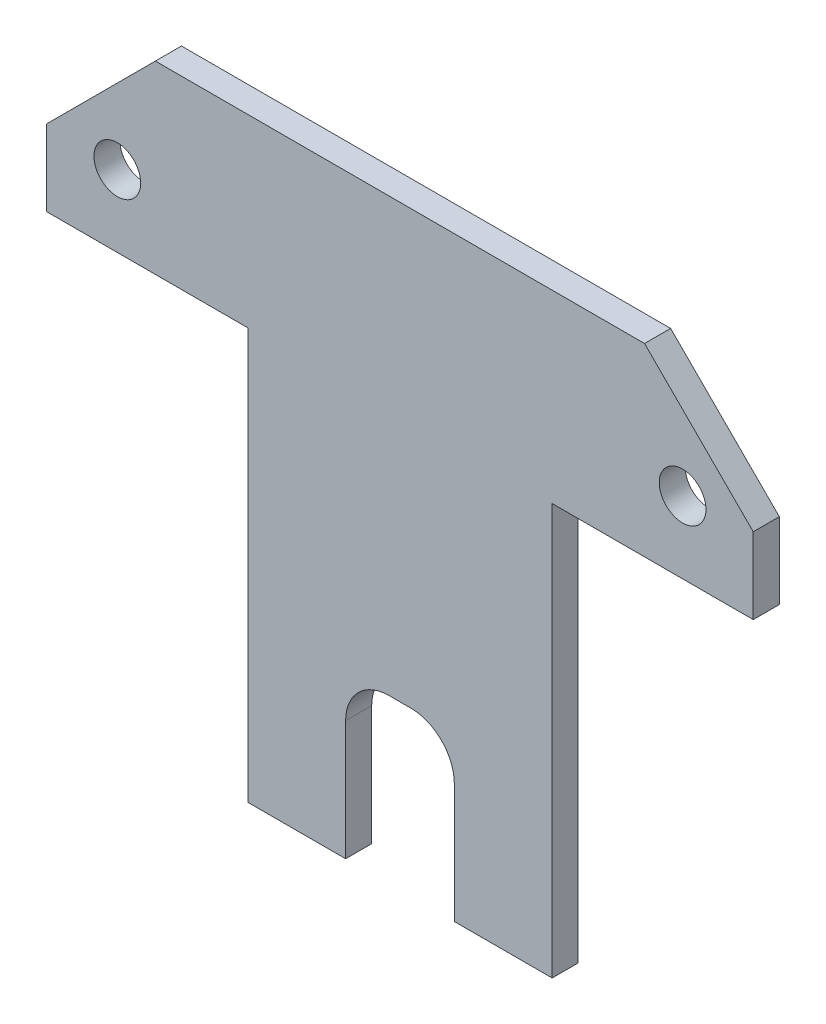
ISO-10303-21;
HEADER;
FILE_DESCRIPTION(('STEP AP214'),'2;1');
FILE_NAME('part.step','',(''),(''),'','','');
FILE_SCHEMA(('AUTOMOTIVE_DESIGN { 1 0 10303 214 1 1 1 1 }'));
ENDSEC;
DATA;
#1=APPLICATION_CONTEXT('core data for automotive mechanical design processes');
#2=APPLICATION_PROTOCOL_DEFINITION('international standard','automotive_design',2000,#1);
#3=PRODUCT_CONTEXT('',#1,'mechanical');
#4=PRODUCT('Part','Part','',(#3));
#5=PRODUCT_RELATED_PRODUCT_CATEGORY('part','',(#4));
#6=PRODUCT_DEFINITION_FORMATION('','',#4);
#7=PRODUCT_DEFINITION_CONTEXT('part definition',#1,'design');
#8=PRODUCT_DEFINITION('design','',#6,#7);
#9=PRODUCT_DEFINITION_SHAPE('','',#8);
#10=(LENGTH_UNIT() NAMED_UNIT(*) SI_UNIT(.MILLI.,.METRE.));
#11=(NAMED_UNIT(*) PLANE_ANGLE_UNIT() SI_UNIT($,.RADIAN.));
#12=(NAMED_UNIT(*) SI_UNIT($,.STERADIAN.) SOLID_ANGLE_UNIT());
#13=UNCERTAINTY_MEASURE_WITH_UNIT(LENGTH_MEASURE(1.E-05),#10,'distance_accuracy_value','');
#14=(GEOMETRIC_REPRESENTATION_CONTEXT(3) GLOBAL_UNCERTAINTY_ASSIGNED_CONTEXT((#13)) GLOBAL_UNIT_ASSIGNED_CONTEXT((#10,
#11,#12)) REPRESENTATION_CONTEXT('',''));
#15=CARTESIAN_POINT('',(0.,0.,0.));
#16=DIRECTION('',(0.,0.,1.));
#17=DIRECTION('',(1.,0.,0.));
#18=AXIS2_PLACEMENT_3D('',#15,#16,#17);
#19=CARTESIAN_POINT('',(15.3944155171797,-21.7253473807906,2.4));
#20=DIRECTION('',(0.,1.,0.));
#21=DIRECTION('',(0.,0.,1.));
#22=AXIS2_PLACEMENT_3D('',#19,#20,#21);
#23=PLANE('',#22);
#24=DIRECTION('',(1.,0.,0.));
#25=VECTOR('',#24,1.);
#26=CARTESIAN_POINT('',(15.3944155171797,-21.7253473807906,0.));
#27=LINE('',#26,#25);
#28=CARTESIAN_POINT('',(-12.6055844828203,-21.7253473807906,0.));
#29=VERTEX_POINT('',#28);
#30=CARTESIAN_POINT('',(-3.60558448282027,-21.7253473807906,0.));
#31=VERTEX_POINT('',#30);
#32=EDGE_CURVE('E161',#29,#31,#27,.T.);
#33=ORIENTED_EDGE('',*,*,#32,.T.);
#34=DIRECTION('',(0.,0.,1.));
#35=VECTOR('',#34,1.);
#36=CARTESIAN_POINT('',(-3.60558448282027,-21.7253473807906,2.4));
#37=LINE('',#36,#35);
#38=CARTESIAN_POINT('',(-3.60558448282027,-21.7253473807906,2.4));
#39=VERTEX_POINT('',#38);
#40=EDGE_CURVE('E149',#31,#39,#37,.T.);
#41=ORIENTED_EDGE('',*,*,#40,.T.);
#42=DIRECTION('',(1.,0.,0.));
#43=VECTOR('',#42,1.);
#44=CARTESIAN_POINT('',(15.3944155171797,-21.7253473807906,2.4));
#45=LINE('',#44,#43);
#46=CARTESIAN_POINT('',(-12.6055844828203,-21.7253473807906,2.4));
#47=VERTEX_POINT('',#46);
#48=EDGE_CURVE('E159',#47,#39,#45,.T.);
#49=ORIENTED_EDGE('',*,*,#48,.F.);
#50=DIRECTION('',(0.,0.,-1.));
#51=VECTOR('',#50,1.);
#52=CARTESIAN_POINT('',(-12.6055844828203,-21.7253473807906,2.4));
#53=LINE('',#52,#51);
#54=EDGE_CURVE('E226',#47,#29,#53,.T.);
#55=ORIENTED_EDGE('',*,*,#54,.T.);
#56=EDGE_LOOP('',(#33,#41,#49,#55));
#57=FACE_BOUND('',#56,.T.);
#58=ADVANCED_FACE('F34',(#57),#23,.F.);
#59=CARTESIAN_POINT('',(0.,0.,2.4));
#60=DIRECTION('',(0.,0.,-1.));
#61=DIRECTION('',(-1.,0.,0.));
#62=AXIS2_PLACEMENT_3D('',#59,#60,#61);
#63=PLANE('',#62);
#64=ORIENTED_EDGE('',*,*,#48,.T.);
#65=DIRECTION('',(0.,-1.,0.));
#66=VECTOR('',#65,1.);
#67=CARTESIAN_POINT('',(-3.60558448282027,-36.7253473807905,2.4));
#68=LINE('',#67,#66);
#69=CARTESIAN_POINT('',(-3.60558448282027,-10.7253473807906,2.4));
#70=VERTEX_POINT('',#69);
#71=EDGE_CURVE('E146',#70,#39,#68,.T.);
#72=ORIENTED_EDGE('',*,*,#71,.F.);
#73=CARTESIAN_POINT('',(0.394415517179731,-10.7253473807906,2.4));
#74=DIRECTION('',(0.,0.,-1.));
#75=DIRECTION('',(-1.,0.,0.));
#76=AXIS2_PLACEMENT_3D('',#73,#74,#75);
#77=CIRCLE('',#76,4.);
#78=CARTESIAN_POINT('',(0.394415517179728,-6.72534738079056,2.4));
#79=VERTEX_POINT('',#78);
#80=EDGE_CURVE('E42',#70,#79,#77,.T.);
#81=ORIENTED_EDGE('',*,*,#80,.T.);
#82=DIRECTION('',(-1.,0.,0.));
#83=VECTOR('',#82,1.);
#84=CARTESIAN_POINT('',(6.39441551717973,-6.72534738079055,2.4));
#85=LINE('',#84,#83);
#86=CARTESIAN_POINT('',(2.39441551717973,-6.72534738079056,2.4));
#87=VERTEX_POINT('',#86);
#88=EDGE_CURVE('E251',#87,#79,#85,.T.);
#89=ORIENTED_EDGE('',*,*,#88,.F.);
#90=CARTESIAN_POINT('',(2.39441551717973,-10.7253473807906,2.4));
#91=DIRECTION('',(0.,0.,-1.));
#92=DIRECTION('',(-1.,0.,0.));
#93=AXIS2_PLACEMENT_3D('',#90,#91,#92);
#94=CIRCLE('',#93,4.);
#95=CARTESIAN_POINT('',(6.39441551717973,-10.7253473807906,2.4));
#96=VERTEX_POINT('',#95);
#97=EDGE_CURVE('E246',#87,#96,#94,.T.);
#98=ORIENTED_EDGE('',*,*,#97,.T.);
#99=DIRECTION('',(0.,1.,0.));
#100=VECTOR('',#99,1.);
#101=CARTESIAN_POINT('',(6.39441551717973,-36.7253473807906,2.4));
#102=LINE('',#101,#100);
#103=CARTESIAN_POINT('',(6.39441551717973,-21.7253473807906,2.4));
#104=VERTEX_POINT('',#103);
#105=EDGE_CURVE('E154',#104,#96,#102,.T.);
#106=ORIENTED_EDGE('',*,*,#105,.F.);
#107=CARTESIAN_POINT('',(15.3944155171797,-21.7253473807906,2.4));
#108=VERTEX_POINT('',#107);
#109=EDGE_CURVE('E171',#104,#108,#45,.T.);
#110=ORIENTED_EDGE('',*,*,#109,.T.);
#111=DIRECTION('',(0.,1.,0.));
#112=VECTOR('',#111,1.);
#113=CARTESIAN_POINT('',(15.3944155171797,16.0746526192094,2.4));
#114=LINE('',#113,#112);
#115=CARTESIAN_POINT('',(15.3944155171797,16.0746526192094,2.4));
#116=VERTEX_POINT('',#115);
#117=EDGE_CURVE('E170',#108,#116,#114,.T.);
#118=ORIENTED_EDGE('',*,*,#117,.T.);
#119=DIRECTION('',(1.,0.,0.));
#120=VECTOR('',#119,1.);
#121=CARTESIAN_POINT('',(33.8944155171797,16.0746526192094,2.4));
#122=LINE('',#121,#120);
#123=CARTESIAN_POINT('',(33.8944155171797,16.0746526192094,2.4));
#124=VERTEX_POINT('',#123);
#125=EDGE_CURVE('E173',#116,#124,#122,.T.);
#126=ORIENTED_EDGE('',*,*,#125,.T.);
#127=DIRECTION('',(0.,1.,0.));
#128=VECTOR('',#127,1.);
#129=CARTESIAN_POINT('',(33.8944155171797,23.0746526192094,2.4));
#130=LINE('',#129,#128);
#131=CARTESIAN_POINT('',(33.8944155171797,23.0746526192094,2.4));
#132=VERTEX_POINT('',#131);
#133=EDGE_CURVE('E179',#124,#132,#130,.T.);
#134=ORIENTED_EDGE('',*,*,#133,.T.);
#135=DIRECTION('',(-0.707106781186548,0.707106781186547,0.));
#136=VECTOR('',#135,1.);
#137=CARTESIAN_POINT('',(23.8944155171797,33.0746526192094,2.4));
#138=LINE('',#137,#136);
#139=CARTESIAN_POINT('',(23.8944155171797,33.0746526192094,2.4));
#140=VERTEX_POINT('',#139);
#141=EDGE_CURVE('E181',#132,#140,#138,.T.);
#142=ORIENTED_EDGE('',*,*,#141,.T.);
#143=DIRECTION('',(-1.,0.,0.));
#144=VECTOR('',#143,1.);
#145=CARTESIAN_POINT('',(-21.1055844828203,33.0746526192094,2.4));
#146=LINE('',#145,#144);
#147=CARTESIAN_POINT('',(-21.1055844828203,33.0746526192094,2.4));
#148=VERTEX_POINT('',#147);
#149=EDGE_CURVE('E183',#140,#148,#146,.T.);
#150=ORIENTED_EDGE('',*,*,#149,.T.);
#151=DIRECTION('',(-0.707106781186548,-0.707106781186547,0.));
#152=VECTOR('',#151,1.);
#153=CARTESIAN_POINT('',(-31.1055844828203,23.0746526192094,2.4));
#154=LINE('',#153,#152);
#155=CARTESIAN_POINT('',(-31.1055844828203,23.0746526192094,2.4));
#156=VERTEX_POINT('',#155);
#157=EDGE_CURVE('E208',#148,#156,#154,.T.);
#158=ORIENTED_EDGE('',*,*,#157,.T.);
#159=DIRECTION('',(0.,-1.,0.));
#160=VECTOR('',#159,1.);
#161=CARTESIAN_POINT('',(-31.1055844828203,16.0746526192094,2.4));
#162=LINE('',#161,#160);
#163=CARTESIAN_POINT('',(-31.1055844828203,16.0746526192094,2.4));
#164=VERTEX_POINT('',#163);
#165=EDGE_CURVE('E312',#156,#164,#162,.T.);
#166=ORIENTED_EDGE('',*,*,#165,.T.);
#167=DIRECTION('',(1.,0.,0.));
#168=VECTOR('',#167,1.);
#169=CARTESIAN_POINT('',(-12.6055844828203,16.0746526192094,2.4));
#170=LINE('',#169,#168);
#171=CARTESIAN_POINT('',(-12.6055844828203,16.0746526192094,2.4));
#172=VERTEX_POINT('',#171);
#173=EDGE_CURVE('E313',#164,#172,#170,.T.);
#174=ORIENTED_EDGE('',*,*,#173,.T.);
#175=DIRECTION('',(0.,-1.,0.));
#176=VECTOR('',#175,1.);
#177=CARTESIAN_POINT('',(-12.6055844828203,-21.7253473807906,2.4));
#178=LINE('',#177,#176);
#179=EDGE_CURVE('E168',#172,#47,#178,.T.);
#180=ORIENTED_EDGE('',*,*,#179,.T.);
#181=EDGE_LOOP('',(#64,#72,#81,#89,#98,#106,#110,#118,#126,#134,#142,#150,#158,#166,#174,#180));
#182=FACE_BOUND('',#181,.T.);
#183=CARTESIAN_POINT('',(-24.6055844828203,22.6746526192094,2.4));
#184=DIRECTION('',(0.,0.,1.));
#185=DIRECTION('',(1.,0.,0.));
#186=AXIS2_PLACEMENT_3D('',#183,#184,#185);
#187=CIRCLE('',#186,2.15);
#188=CARTESIAN_POINT('',(-22.4555844828203,22.6746526192094,2.4));
#189=VERTEX_POINT('',#188);
#190=EDGE_CURVE('E190',#189,#189,#187,.T.);
#191=ORIENTED_EDGE('',*,*,#190,.F.);
#192=EDGE_LOOP('',(#191));
#193=FACE_BOUND('',#192,.T.);
#194=CARTESIAN_POINT('',(27.3944155171797,22.6746526192094,2.4));
#195=DIRECTION('',(0.,0.,1.));
#196=DIRECTION('',(1.,0.,0.));
#197=AXIS2_PLACEMENT_3D('',#194,#195,#196);
#198=CIRCLE('',#197,2.15);
#199=CARTESIAN_POINT('',(29.5444155171797,22.6746526192094,2.4));
#200=VERTEX_POINT('',#199);
#201=EDGE_CURVE('E298',#200,#200,#198,.T.);
#202=ORIENTED_EDGE('',*,*,#201,.F.);
#203=EDGE_LOOP('',(#202));
#204=FACE_BOUND('',#203,.T.);
#205=ADVANCED_FACE('F165',(#182,#193,#204),#63,.F.);
#206=CARTESIAN_POINT('',(0.,0.,0.));
#207=DIRECTION('',(0.,0.,-1.));
#208=DIRECTION('',(-1.,0.,0.));
#209=AXIS2_PLACEMENT_3D('',#206,#207,#208);
#210=PLANE('',#209);
#211=DIRECTION('',(-1.,0.,0.));
#212=VECTOR('',#211,1.);
#213=CARTESIAN_POINT('',(6.39441551717973,-6.72534738079055,0.));
#214=LINE('',#213,#212);
#215=CARTESIAN_POINT('',(2.39441551717973,-6.72534738079056,0.));
#216=VERTEX_POINT('',#215);
#217=CARTESIAN_POINT('',(0.394415517179728,-6.72534738079056,0.));
#218=VERTEX_POINT('',#217);
#219=EDGE_CURVE('E305',#216,#218,#214,.T.);
#220=ORIENTED_EDGE('',*,*,#219,.T.);
#221=CARTESIAN_POINT('',(0.394415517179731,-10.7253473807906,0.));
#222=DIRECTION('',(0.,0.,-1.));
#223=DIRECTION('',(-1.,0.,0.));
#224=AXIS2_PLACEMENT_3D('',#221,#222,#223);
#225=CIRCLE('',#224,4.);
#226=CARTESIAN_POINT('',(-3.60558448282027,-10.7253473807906,0.));
#227=VERTEX_POINT('',#226);
#228=EDGE_CURVE('E11',#218,#227,#225,.F.);
#229=ORIENTED_EDGE('',*,*,#228,.T.);
#230=DIRECTION('',(0.,-1.,0.));
#231=VECTOR('',#230,1.);
#232=CARTESIAN_POINT('',(-3.60558448282027,-36.7253473807905,0.));
#233=LINE('',#232,#231);
#234=EDGE_CURVE('E256',#227,#31,#233,.T.);
#235=ORIENTED_EDGE('',*,*,#234,.T.);
#236=ORIENTED_EDGE('',*,*,#32,.F.);
#237=DIRECTION('',(0.,-1.,0.));
#238=VECTOR('',#237,1.);
#239=CARTESIAN_POINT('',(-12.6055844828203,-21.7253473807906,0.));
#240=LINE('',#239,#238);
#241=CARTESIAN_POINT('',(-12.6055844828203,16.0746526192094,0.));
#242=VERTEX_POINT('',#241);
#243=EDGE_CURVE('E194',#242,#29,#240,.T.);
#244=ORIENTED_EDGE('',*,*,#243,.F.);
#245=DIRECTION('',(1.,0.,0.));
#246=VECTOR('',#245,1.);
#247=CARTESIAN_POINT('',(-12.6055844828203,16.0746526192094,0.));
#248=LINE('',#247,#246);
#249=CARTESIAN_POINT('',(-31.1055844828203,16.0746526192094,0.));
#250=VERTEX_POINT('',#249);
#251=EDGE_CURVE('E192',#250,#242,#248,.T.);
#252=ORIENTED_EDGE('',*,*,#251,.F.);
#253=DIRECTION('',(0.,-1.,0.));
#254=VECTOR('',#253,1.);
#255=CARTESIAN_POINT('',(-31.1055844828203,16.0746526192094,0.));
#256=LINE('',#255,#254);
#257=CARTESIAN_POINT('',(-31.1055844828203,23.0746526192094,0.));
#258=VERTEX_POINT('',#257);
#259=EDGE_CURVE('E189',#258,#250,#256,.T.);
#260=ORIENTED_EDGE('',*,*,#259,.F.);
#261=DIRECTION('',(-0.707106781186548,-0.707106781186547,0.));
#262=VECTOR('',#261,1.);
#263=CARTESIAN_POINT('',(-31.1055844828203,23.0746526192094,0.));
#264=LINE('',#263,#262);
#265=CARTESIAN_POINT('',(-21.1055844828203,33.0746526192094,0.));
#266=VERTEX_POINT('',#265);
#267=EDGE_CURVE('E186',#266,#258,#264,.T.);
#268=ORIENTED_EDGE('',*,*,#267,.F.);
#269=DIRECTION('',(-1.,0.,0.));
#270=VECTOR('',#269,1.);
#271=CARTESIAN_POINT('',(-21.1055844828203,33.0746526192094,0.));
#272=LINE('',#271,#270);
#273=CARTESIAN_POINT('',(23.8944155171797,33.0746526192094,0.));
#274=VERTEX_POINT('',#273);
#275=EDGE_CURVE('E206',#274,#266,#272,.T.);
#276=ORIENTED_EDGE('',*,*,#275,.F.);
#277=DIRECTION('',(-0.707106781186548,0.707106781186547,0.));
#278=VECTOR('',#277,1.);
#279=CARTESIAN_POINT('',(23.8944155171797,33.0746526192094,0.));
#280=LINE('',#279,#278);
#281=CARTESIAN_POINT('',(33.8944155171797,23.0746526192094,0.));
#282=VERTEX_POINT('',#281);
#283=EDGE_CURVE('E204',#282,#274,#280,.T.);
#284=ORIENTED_EDGE('',*,*,#283,.F.);
#285=DIRECTION('',(0.,1.,0.));
#286=VECTOR('',#285,1.);
#287=CARTESIAN_POINT('',(33.8944155171797,23.0746526192094,0.));
#288=LINE('',#287,#286);
#289=CARTESIAN_POINT('',(33.8944155171797,16.0746526192094,0.));
#290=VERTEX_POINT('',#289);
#291=EDGE_CURVE('E202',#290,#282,#288,.T.);
#292=ORIENTED_EDGE('',*,*,#291,.F.);
#293=DIRECTION('',(1.,0.,0.));
#294=VECTOR('',#293,1.);
#295=CARTESIAN_POINT('',(33.8944155171797,16.0746526192094,0.));
#296=LINE('',#295,#294);
#297=CARTESIAN_POINT('',(15.3944155171797,16.0746526192094,0.));
#298=VERTEX_POINT('',#297);
#299=EDGE_CURVE('E200',#298,#290,#296,.T.);
#300=ORIENTED_EDGE('',*,*,#299,.F.);
#301=DIRECTION('',(0.,1.,0.));
#302=VECTOR('',#301,1.);
#303=CARTESIAN_POINT('',(15.3944155171797,16.0746526192094,0.));
#304=LINE('',#303,#302);
#305=CARTESIAN_POINT('',(15.3944155171797,-21.7253473807906,0.));
#306=VERTEX_POINT('',#305);
#307=EDGE_CURVE('E198',#306,#298,#304,.T.);
#308=ORIENTED_EDGE('',*,*,#307,.F.);
#309=CARTESIAN_POINT('',(6.39441551717973,-21.7253473807906,0.));
#310=VERTEX_POINT('',#309);
#311=EDGE_CURVE('E196',#310,#306,#27,.T.);
#312=ORIENTED_EDGE('',*,*,#311,.F.);
#313=DIRECTION('',(0.,1.,0.));
#314=VECTOR('',#313,1.);
#315=CARTESIAN_POINT('',(6.39441551717973,-36.7253473807906,0.));
#316=LINE('',#315,#314);
#317=CARTESIAN_POINT('',(6.39441551717973,-10.7253473807906,0.));
#318=VERTEX_POINT('',#317);
#319=EDGE_CURVE('E321',#310,#318,#316,.T.);
#320=ORIENTED_EDGE('',*,*,#319,.T.);
#321=CARTESIAN_POINT('',(2.39441551717973,-10.7253473807906,0.));
#322=DIRECTION('',(0.,0.,-1.));
#323=DIRECTION('',(-1.,0.,0.));
#324=AXIS2_PLACEMENT_3D('',#321,#322,#323);
#325=CIRCLE('',#324,4.);
#326=EDGE_CURVE('E248',#318,#216,#325,.F.);
#327=ORIENTED_EDGE('',*,*,#326,.T.);
#328=EDGE_LOOP('',(#220,#229,#235,#236,#244,#252,#260,#268,#276,#284,#292,#300,#308,#312,#320,#327));
#329=FACE_BOUND('',#328,.T.);
#330=CARTESIAN_POINT('',(-24.6055844828203,22.6746526192094,0.));
#331=DIRECTION('',(0.,0.,1.));
#332=DIRECTION('',(1.,0.,0.));
#333=AXIS2_PLACEMENT_3D('',#330,#331,#332);
#334=CIRCLE('',#333,2.15);
#335=CARTESIAN_POINT('',(-22.4555844828203,22.6746526192094,0.));
#336=VERTEX_POINT('',#335);
#337=EDGE_CURVE('E301',#336,#336,#334,.T.);
#338=ORIENTED_EDGE('',*,*,#337,.T.);
#339=EDGE_LOOP('',(#338));
#340=FACE_BOUND('',#339,.T.);
#341=CARTESIAN_POINT('',(27.3944155171797,22.6746526192094,0.));
#342=DIRECTION('',(0.,0.,1.));
#343=DIRECTION('',(1.,0.,0.));
#344=AXIS2_PLACEMENT_3D('',#341,#342,#343);
#345=CIRCLE('',#344,2.15);
#346=CARTESIAN_POINT('',(29.5444155171797,22.6746526192094,0.));
#347=VERTEX_POINT('',#346);
#348=EDGE_CURVE('E302',#347,#347,#345,.T.);
#349=ORIENTED_EDGE('',*,*,#348,.T.);
#350=EDGE_LOOP('',(#349));
#351=FACE_BOUND('',#350,.T.);
#352=ADVANCED_FACE('F270',(#329,#340,#351),#210,.T.);
#353=CARTESIAN_POINT('',(-31.1055844828203,23.0746526192094,2.4));
#354=DIRECTION('',(0.707106781186547,-0.707106781186548,0.));
#355=DIRECTION('',(0.707106781186548,0.707106781186547,0.));
#356=AXIS2_PLACEMENT_3D('',#353,#354,#355);
#357=PLANE('',#356);
#358=ORIENTED_EDGE('',*,*,#267,.T.);
#359=DIRECTION('',(0.,0.,-1.));
#360=VECTOR('',#359,1.);
#361=CARTESIAN_POINT('',(-31.1055844828203,23.0746526192094,2.4));
#362=LINE('',#361,#360);
#363=EDGE_CURVE('E234',#156,#258,#362,.T.);
#364=ORIENTED_EDGE('',*,*,#363,.F.);
#365=ORIENTED_EDGE('',*,*,#157,.F.);
#366=DIRECTION('',(0.,0.,-1.));
#367=VECTOR('',#366,1.);
#368=CARTESIAN_POINT('',(-21.1055844828203,33.0746526192094,2.4));
#369=LINE('',#368,#367);
#370=EDGE_CURVE('E185',#148,#266,#369,.T.);
#371=ORIENTED_EDGE('',*,*,#370,.T.);
#372=EDGE_LOOP('',(#358,#364,#365,#371));
#373=FACE_BOUND('',#372,.T.);
#374=ADVANCED_FACE('F350',(#373),#357,.F.);
#375=CARTESIAN_POINT('',(-31.1055844828203,16.0746526192094,2.4));
#376=DIRECTION('',(1.,0.,0.));
#377=DIRECTION('',(0.,0.,-1.));
#378=AXIS2_PLACEMENT_3D('',#375,#376,#377);
#379=PLANE('',#378);
#380=ORIENTED_EDGE('',*,*,#259,.T.);
#381=DIRECTION('',(0.,0.,-1.));
#382=VECTOR('',#381,1.);
#383=CARTESIAN_POINT('',(-31.1055844828203,16.0746526192094,2.4));
#384=LINE('',#383,#382);
#385=EDGE_CURVE('E231',#164,#250,#384,.T.);
#386=ORIENTED_EDGE('',*,*,#385,.F.);
#387=ORIENTED_EDGE('',*,*,#165,.F.);
#388=ORIENTED_EDGE('',*,*,#363,.T.);
#389=EDGE_LOOP('',(#380,#386,#387,#388));
#390=FACE_BOUND('',#389,.T.);
#391=ADVANCED_FACE('F353',(#390),#379,.F.);
#392=CARTESIAN_POINT('',(-12.6055844828203,16.0746526192094,2.4));
#393=DIRECTION('',(0.,1.,0.));
#394=DIRECTION('',(0.,0.,1.));
#395=AXIS2_PLACEMENT_3D('',#392,#393,#394);
#396=PLANE('',#395);
#397=ORIENTED_EDGE('',*,*,#251,.T.);
#398=DIRECTION('',(0.,0.,-1.));
#399=VECTOR('',#398,1.);
#400=CARTESIAN_POINT('',(-12.6055844828203,16.0746526192094,2.4));
#401=LINE('',#400,#399);
#402=EDGE_CURVE('E228',#172,#242,#401,.T.);
#403=ORIENTED_EDGE('',*,*,#402,.F.);
#404=ORIENTED_EDGE('',*,*,#173,.F.);
#405=ORIENTED_EDGE('',*,*,#385,.T.);
#406=EDGE_LOOP('',(#397,#403,#404,#405));
#407=FACE_BOUND('',#406,.T.);
#408=ADVANCED_FACE('F284',(#407),#396,.F.);
#409=CARTESIAN_POINT('',(-12.6055844828203,-21.7253473807906,2.4));
#410=DIRECTION('',(1.,0.,0.));
#411=DIRECTION('',(0.,0.,-1.));
#412=AXIS2_PLACEMENT_3D('',#409,#410,#411);
#413=PLANE('',#412);
#414=ORIENTED_EDGE('',*,*,#243,.T.);
#415=ORIENTED_EDGE('',*,*,#54,.F.);
#416=ORIENTED_EDGE('',*,*,#179,.F.);
#417=ORIENTED_EDGE('',*,*,#402,.T.);
#418=EDGE_LOOP('',(#414,#415,#416,#417));
#419=FACE_BOUND('',#418,.T.);
#420=ADVANCED_FACE('F276',(#419),#413,.F.);
#421=ORIENTED_EDGE('',*,*,#109,.F.);
#422=DIRECTION('',(0.,0.,-1.));
#423=VECTOR('',#422,1.);
#424=CARTESIAN_POINT('',(6.39441551717973,-21.7253473807906,2.4));
#425=LINE('',#424,#423);
#426=EDGE_CURVE('E163',#104,#310,#425,.T.);
#427=ORIENTED_EDGE('',*,*,#426,.T.);
#428=ORIENTED_EDGE('',*,*,#311,.T.);
#429=DIRECTION('',(0.,0.,-1.));
#430=VECTOR('',#429,1.);
#431=CARTESIAN_POINT('',(15.3944155171797,-21.7253473807906,2.4));
#432=LINE('',#431,#430);
#433=EDGE_CURVE('E223',#108,#306,#432,.T.);
#434=ORIENTED_EDGE('',*,*,#433,.F.);
#435=EDGE_LOOP('',(#421,#427,#428,#434));
#436=FACE_BOUND('',#435,.T.);
#437=ADVANCED_FACE('F266',(#436),#23,.F.);
#438=CARTESIAN_POINT('',(15.3944155171797,16.0746526192094,2.4));
#439=DIRECTION('',(-1.,0.,0.));
#440=DIRECTION('',(0.,-1.,0.));
#441=AXIS2_PLACEMENT_3D('',#438,#439,#440);
#442=PLANE('',#441);
#443=ORIENTED_EDGE('',*,*,#307,.T.);
#444=DIRECTION('',(0.,0.,-1.));
#445=VECTOR('',#444,1.);
#446=CARTESIAN_POINT('',(15.3944155171797,16.0746526192094,2.4));
#447=LINE('',#446,#445);
#448=EDGE_CURVE('E220',#116,#298,#447,.T.);
#449=ORIENTED_EDGE('',*,*,#448,.F.);
#450=ORIENTED_EDGE('',*,*,#117,.F.);
#451=ORIENTED_EDGE('',*,*,#433,.T.);
#452=EDGE_LOOP('',(#443,#449,#450,#451));
#453=FACE_BOUND('',#452,.T.);
#454=ADVANCED_FACE('F275',(#453),#442,.F.);
#455=CARTESIAN_POINT('',(33.8944155171797,16.0746526192094,2.4));
#456=DIRECTION('',(0.,1.,0.));
#457=DIRECTION('',(0.,0.,1.));
#458=AXIS2_PLACEMENT_3D('',#455,#456,#457);
#459=PLANE('',#458);
#460=ORIENTED_EDGE('',*,*,#299,.T.);
#461=DIRECTION('',(0.,0.,-1.));
#462=VECTOR('',#461,1.);
#463=CARTESIAN_POINT('',(33.8944155171797,16.0746526192094,2.4));
#464=LINE('',#463,#462);
#465=EDGE_CURVE('E217',#124,#290,#464,.T.);
#466=ORIENTED_EDGE('',*,*,#465,.F.);
#467=ORIENTED_EDGE('',*,*,#125,.F.);
#468=ORIENTED_EDGE('',*,*,#448,.T.);
#469=EDGE_LOOP('',(#460,#466,#467,#468));
#470=FACE_BOUND('',#469,.T.);
#471=ADVANCED_FACE('F282',(#470),#459,.F.);
#472=CARTESIAN_POINT('',(33.8944155171797,23.0746526192094,2.4));
#473=DIRECTION('',(-1.,0.,0.));
#474=DIRECTION('',(0.,0.,1.));
#475=AXIS2_PLACEMENT_3D('',#472,#473,#474);
#476=PLANE('',#475);
#477=ORIENTED_EDGE('',*,*,#291,.T.);
#478=DIRECTION('',(0.,0.,-1.));
#479=VECTOR('',#478,1.);
#480=CARTESIAN_POINT('',(33.8944155171797,23.0746526192094,2.4));
#481=LINE('',#480,#479);
#482=EDGE_CURVE('E214',#132,#282,#481,.T.);
#483=ORIENTED_EDGE('',*,*,#482,.F.);
#484=ORIENTED_EDGE('',*,*,#133,.F.);
#485=ORIENTED_EDGE('',*,*,#465,.T.);
#486=EDGE_LOOP('',(#477,#483,#484,#485));
#487=FACE_BOUND('',#486,.T.);
#488=ADVANCED_FACE('F337',(#487),#476,.F.);
#489=CARTESIAN_POINT('',(23.8944155171797,33.0746526192094,2.4));
#490=DIRECTION('',(-0.707106781186547,-0.707106781186548,0.));
#491=DIRECTION('',(0.707106781186548,-0.707106781186547,0.));
#492=AXIS2_PLACEMENT_3D('',#489,#490,#491);
#493=PLANE('',#492);
#494=ORIENTED_EDGE('',*,*,#283,.T.);
#495=DIRECTION('',(0.,0.,-1.));
#496=VECTOR('',#495,1.);
#497=CARTESIAN_POINT('',(23.8944155171797,33.0746526192094,2.4));
#498=LINE('',#497,#496);
#499=EDGE_CURVE('E211',#140,#274,#498,.T.);
#500=ORIENTED_EDGE('',*,*,#499,.F.);
#501=ORIENTED_EDGE('',*,*,#141,.F.);
#502=ORIENTED_EDGE('',*,*,#482,.T.);
#503=EDGE_LOOP('',(#494,#500,#501,#502));
#504=FACE_BOUND('',#503,.T.);
#505=ADVANCED_FACE('F341',(#504),#493,.F.);
#506=CARTESIAN_POINT('',(-21.1055844828203,33.0746526192094,2.4));
#507=DIRECTION('',(0.,-1.,0.));
#508=DIRECTION('',(0.,0.,-1.));
#509=AXIS2_PLACEMENT_3D('',#506,#507,#508);
#510=PLANE('',#509);
#511=ORIENTED_EDGE('',*,*,#275,.T.);
#512=ORIENTED_EDGE('',*,*,#370,.F.);
#513=ORIENTED_EDGE('',*,*,#149,.F.);
#514=ORIENTED_EDGE('',*,*,#499,.T.);
#515=EDGE_LOOP('',(#511,#512,#513,#514));
#516=FACE_BOUND('',#515,.T.);
#517=ADVANCED_FACE('F346',(#516),#510,.F.);
#518=CARTESIAN_POINT('',(-24.6055844828203,22.6746526192094,2.4));
#519=DIRECTION('',(0.,0.,-1.));
#520=DIRECTION('',(-1.,0.,0.));
#521=AXIS2_PLACEMENT_3D('',#518,#519,#520);
#522=CYLINDRICAL_SURFACE('',#521,2.15);
#523=ORIENTED_EDGE('',*,*,#190,.T.);
#524=EDGE_LOOP('',(#523));
#525=FACE_BOUND('',#524,.T.);
#526=ORIENTED_EDGE('',*,*,#337,.F.);
#527=EDGE_LOOP('',(#526));
#528=FACE_BOUND('',#527,.T.);
#529=ADVANCED_FACE('F372',(#525,#528),#522,.F.);
#530=CARTESIAN_POINT('',(27.3944155171797,22.6746526192094,2.4));
#531=DIRECTION('',(0.,0.,-1.));
#532=DIRECTION('',(-1.,0.,0.));
#533=AXIS2_PLACEMENT_3D('',#530,#531,#532);
#534=CYLINDRICAL_SURFACE('',#533,2.15);
#535=ORIENTED_EDGE('',*,*,#201,.T.);
#536=EDGE_LOOP('',(#535));
#537=FACE_BOUND('',#536,.T.);
#538=ORIENTED_EDGE('',*,*,#348,.F.);
#539=EDGE_LOOP('',(#538));
#540=FACE_BOUND('',#539,.T.);
#541=ADVANCED_FACE('F400',(#537,#540),#534,.F.);
#542=CARTESIAN_POINT('',(-3.60558448282027,-36.7253473807905,0.));
#543=DIRECTION('',(-1.,0.,0.));
#544=DIRECTION('',(0.,-1.,0.));
#545=AXIS2_PLACEMENT_3D('',#542,#543,#544);
#546=PLANE('',#545);
#547=ORIENTED_EDGE('',*,*,#234,.F.);
#548=DIRECTION('',(0.,0.,1.));
#549=VECTOR('',#548,1.);
#550=CARTESIAN_POINT('',(-3.60558448282027,-10.7253473807906,2.4));
#551=LINE('',#550,#549);
#552=EDGE_CURVE('E151',#227,#70,#551,.T.);
#553=ORIENTED_EDGE('',*,*,#552,.T.);
#554=ORIENTED_EDGE('',*,*,#71,.T.);
#555=ORIENTED_EDGE('',*,*,#40,.F.);
#556=EDGE_LOOP('',(#547,#553,#554,#555));
#557=FACE_BOUND('',#556,.T.);
#558=ADVANCED_FACE('F148',(#557),#546,.F.);
#559=CARTESIAN_POINT('',(6.39441551717973,-36.7253473807906,0.));
#560=DIRECTION('',(1.,0.,0.));
#561=DIRECTION('',(0.,1.,0.));
#562=AXIS2_PLACEMENT_3D('',#559,#560,#561);
#563=PLANE('',#562);
#564=ORIENTED_EDGE('',*,*,#105,.T.);
#565=DIRECTION('',(0.,0.,1.));
#566=VECTOR('',#565,1.);
#567=CARTESIAN_POINT('',(6.39441551717973,-10.7253473807906,0.));
#568=LINE('',#567,#566);
#569=EDGE_CURVE('E243',#96,#318,#568,.F.);
#570=ORIENTED_EDGE('',*,*,#569,.T.);
#571=ORIENTED_EDGE('',*,*,#319,.F.);
#572=ORIENTED_EDGE('',*,*,#426,.F.);
#573=EDGE_LOOP('',(#564,#570,#571,#572));
#574=FACE_BOUND('',#573,.T.);
#575=ADVANCED_FACE('F326',(#574),#563,.F.);
#576=CARTESIAN_POINT('',(6.39441551717973,-6.72534738079055,0.));
#577=DIRECTION('',(0.,1.,0.));
#578=DIRECTION('',(-1.,0.,0.));
#579=AXIS2_PLACEMENT_3D('',#576,#577,#578);
#580=PLANE('',#579);
#581=ORIENTED_EDGE('',*,*,#219,.F.);
#582=DIRECTION('',(0.,0.,1.));
#583=VECTOR('',#582,1.);
#584=CARTESIAN_POINT('',(2.39441551717973,-6.72534738079056,2.4));
#585=LINE('',#584,#583);
#586=EDGE_CURVE('E240',#216,#87,#585,.T.);
#587=ORIENTED_EDGE('',*,*,#586,.T.);
#588=ORIENTED_EDGE('',*,*,#88,.T.);
#589=DIRECTION('',(0.,0.,1.));
#590=VECTOR('',#589,1.);
#591=CARTESIAN_POINT('',(0.394415517179728,-6.72534738079056,0.));
#592=LINE('',#591,#590);
#593=EDGE_CURVE('E162',#79,#218,#592,.F.);
#594=ORIENTED_EDGE('',*,*,#593,.T.);
#595=EDGE_LOOP('',(#581,#587,#588,#594));
#596=FACE_BOUND('',#595,.T.);
#597=ADVANCED_FACE('F254',(#596),#580,.F.);
#598=CARTESIAN_POINT('',(2.39441551717973,-10.7253473807906,0.));
#599=DIRECTION('',(0.,0.,-1.));
#600=DIRECTION('',(-1.,0.,0.));
#601=AXIS2_PLACEMENT_3D('',#598,#599,#600);
#602=CYLINDRICAL_SURFACE('',#601,4.);
#603=ORIENTED_EDGE('',*,*,#326,.F.);
#604=ORIENTED_EDGE('',*,*,#569,.F.);
#605=ORIENTED_EDGE('',*,*,#97,.F.);
#606=ORIENTED_EDGE('',*,*,#586,.F.);
#607=EDGE_LOOP('',(#603,#604,#605,#606));
#608=FACE_BOUND('',#607,.T.);
#609=ADVANCED_FACE('F259',(#608),#602,.F.);
#610=CARTESIAN_POINT('',(0.394415517179731,-10.7253473807906,0.));
#611=DIRECTION('',(0.,0.,-1.));
#612=DIRECTION('',(-1.,0.,0.));
#613=AXIS2_PLACEMENT_3D('',#610,#611,#612);
#614=CYLINDRICAL_SURFACE('',#613,4.);
#615=ORIENTED_EDGE('',*,*,#228,.F.);
#616=ORIENTED_EDGE('',*,*,#593,.F.);
#617=ORIENTED_EDGE('',*,*,#80,.F.);
#618=ORIENTED_EDGE('',*,*,#552,.F.);
#619=EDGE_LOOP('',(#615,#616,#617,#618));
#620=FACE_BOUND('',#619,.T.);
#621=ADVANCED_FACE('F36',(#620),#614,.F.);
#622=CLOSED_SHELL('',(#58,#205,#352,#374,#391,#408,#420,#437,#454,#471,#488,#505,#517,#529,#541,
#558,#575,#597,#609,#621));
#623=MANIFOLD_SOLID_BREP('B2',#622);
#624=ADVANCED_BREP_SHAPE_REPRESENTATION('',(#18,#623),#14);
#625=SHAPE_DEFINITION_REPRESENTATION(#9,#624);
ENDSEC;
END-ISO-10303-21;
